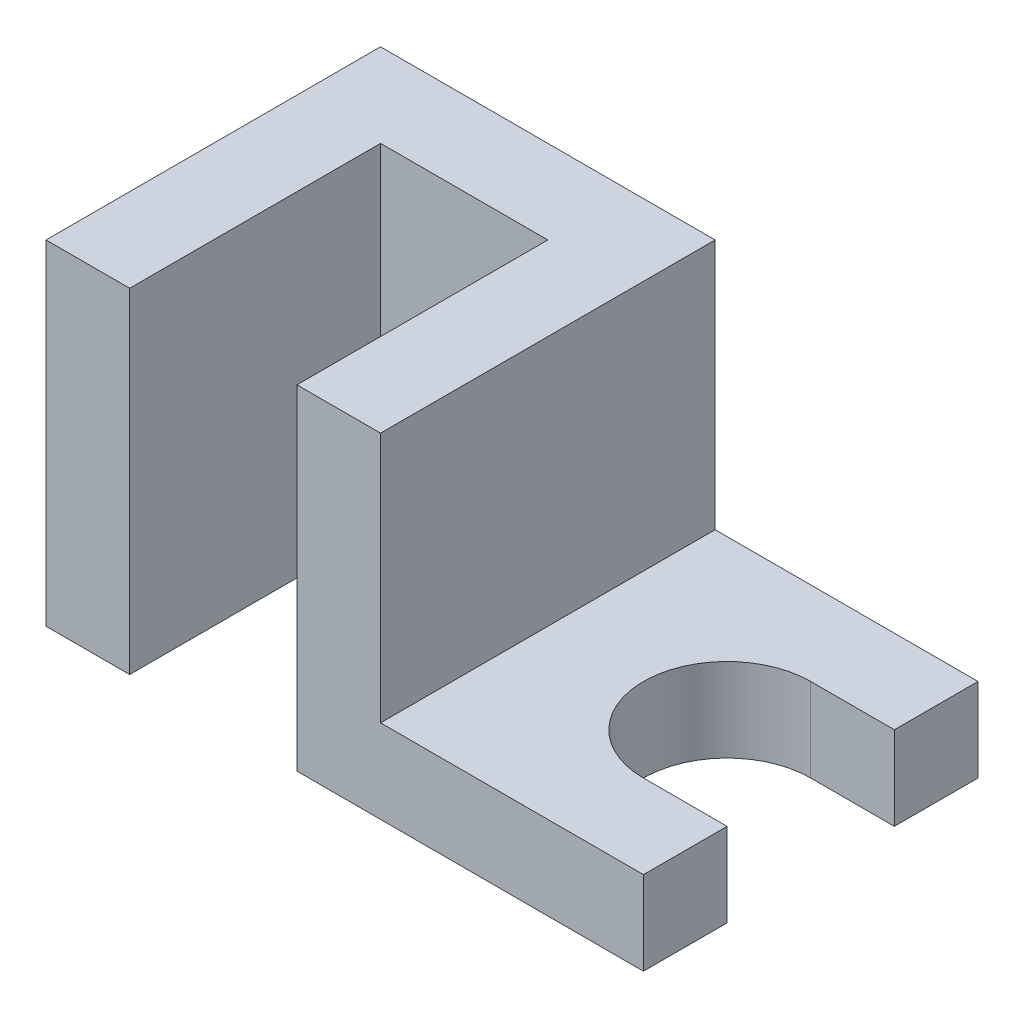
ISO-10303-21;
HEADER;
FILE_DESCRIPTION(('STEP AP214'),'2;1');
FILE_NAME('part.step','',(''),(''),'','','');
FILE_SCHEMA(('AUTOMOTIVE_DESIGN { 1 0 10303 214 1 1 1 1 }'));
ENDSEC;
DATA;
#1=APPLICATION_CONTEXT('core data for automotive mechanical design processes');
#2=APPLICATION_PROTOCOL_DEFINITION('international standard','automotive_design',2000,#1);
#3=PRODUCT_CONTEXT('',#1,'mechanical');
#4=PRODUCT('Part','Part','',(#3));
#5=PRODUCT_RELATED_PRODUCT_CATEGORY('part','',(#4));
#6=PRODUCT_DEFINITION_FORMATION('','',#4);
#7=PRODUCT_DEFINITION_CONTEXT('part definition',#1,'design');
#8=PRODUCT_DEFINITION('design','',#6,#7);
#9=PRODUCT_DEFINITION_SHAPE('','',#8);
#10=(LENGTH_UNIT() NAMED_UNIT(*) SI_UNIT(.MILLI.,.METRE.));
#11=(NAMED_UNIT(*) PLANE_ANGLE_UNIT() SI_UNIT($,.RADIAN.));
#12=(NAMED_UNIT(*) SI_UNIT($,.STERADIAN.) SOLID_ANGLE_UNIT());
#13=UNCERTAINTY_MEASURE_WITH_UNIT(LENGTH_MEASURE(1.E-05),#10,'distance_accuracy_value','');
#14=(GEOMETRIC_REPRESENTATION_CONTEXT(3) GLOBAL_UNCERTAINTY_ASSIGNED_CONTEXT((#13)) GLOBAL_UNIT_ASSIGNED_CONTEXT((#10,
#11,#12)) REPRESENTATION_CONTEXT('',''));
#15=CARTESIAN_POINT('',(0.,0.,0.));
#16=DIRECTION('',(0.,0.,1.));
#17=DIRECTION('',(1.,0.,0.));
#18=AXIS2_PLACEMENT_3D('',#15,#16,#17);
#19=CARTESIAN_POINT('',(43.,7.,-14.));
#20=DIRECTION('',(0.,-1.,0.));
#21=DIRECTION('',(0.,0.,-1.));
#22=AXIS2_PLACEMENT_3D('',#19,#20,#21);
#23=CYLINDRICAL_SURFACE('',#22,7.);
#24=CARTESIAN_POINT('',(43.,0.,-14.));
#25=DIRECTION('',(0.,1.,0.));
#26=DIRECTION('',(0.,0.,1.));
#27=AXIS2_PLACEMENT_3D('',#24,#25,#26);
#28=CIRCLE('',#27,7.);
#29=CARTESIAN_POINT('',(43.,0.,-21.));
#30=VERTEX_POINT('',#29);
#31=CARTESIAN_POINT('',(43.,0.,-7.00000000000001));
#32=VERTEX_POINT('',#31);
#33=EDGE_CURVE('E130',#30,#32,#28,.T.);
#34=ORIENTED_EDGE('',*,*,#33,.F.);
#35=DIRECTION('',(0.,-1.,0.));
#36=VECTOR('',#35,1.);
#37=CARTESIAN_POINT('',(43.,7.,-21.));
#38=LINE('',#37,#36);
#39=CARTESIAN_POINT('',(43.,7.,-21.));
#40=VERTEX_POINT('',#39);
#41=EDGE_CURVE('E11',#40,#30,#38,.T.);
#42=ORIENTED_EDGE('',*,*,#41,.F.);
#43=CARTESIAN_POINT('',(43.,7.,-14.));
#44=DIRECTION('',(0.,1.,0.));
#45=DIRECTION('',(0.,0.,1.));
#46=AXIS2_PLACEMENT_3D('',#43,#44,#45);
#47=CIRCLE('',#46,7.);
#48=CARTESIAN_POINT('',(43.,7.,-7.00000000000001));
#49=VERTEX_POINT('',#48);
#50=EDGE_CURVE('E148',#40,#49,#47,.T.);
#51=ORIENTED_EDGE('',*,*,#50,.T.);
#52=DIRECTION('',(0.,-1.,0.));
#53=VECTOR('',#52,1.);
#54=CARTESIAN_POINT('',(43.,7.,-7.00000000000001));
#55=LINE('',#54,#53);
#56=EDGE_CURVE('E57',#49,#32,#55,.T.);
#57=ORIENTED_EDGE('',*,*,#56,.T.);
#58=EDGE_LOOP('',(#34,#42,#51,#57));
#59=FACE_BOUND('',#58,.T.);
#60=ADVANCED_FACE('F41',(#59),#23,.F.);
#61=CARTESIAN_POINT('',(0.,7.,-21.));
#62=DIRECTION('',(0.,0.,1.));
#63=DIRECTION('',(1.,0.,0.));
#64=AXIS2_PLACEMENT_3D('',#61,#62,#63);
#65=PLANE('',#64);
#66=DIRECTION('',(-1.,0.,0.));
#67=VECTOR('',#66,1.);
#68=CARTESIAN_POINT('',(0.,0.,-21.));
#69=LINE('',#68,#67);
#70=CARTESIAN_POINT('',(50.,0.,-21.));
#71=VERTEX_POINT('',#70);
#72=EDGE_CURVE('E132',#71,#30,#69,.T.);
#73=ORIENTED_EDGE('',*,*,#72,.F.);
#74=DIRECTION('',(0.,-1.,0.));
#75=VECTOR('',#74,1.);
#76=CARTESIAN_POINT('',(50.,7.,-21.));
#77=LINE('',#76,#75);
#78=CARTESIAN_POINT('',(50.,7.,-21.));
#79=VERTEX_POINT('',#78);
#80=EDGE_CURVE('E49',#79,#71,#77,.T.);
#81=ORIENTED_EDGE('',*,*,#80,.F.);
#82=DIRECTION('',(-1.,0.,0.));
#83=VECTOR('',#82,1.);
#84=CARTESIAN_POINT('',(0.,7.,-21.));
#85=LINE('',#84,#83);
#86=EDGE_CURVE('E197',#79,#40,#85,.T.);
#87=ORIENTED_EDGE('',*,*,#86,.T.);
#88=ORIENTED_EDGE('',*,*,#41,.T.);
#89=EDGE_LOOP('',(#73,#81,#87,#88));
#90=FACE_BOUND('',#89,.T.);
#91=ADVANCED_FACE('F161',(#90),#65,.T.);
#92=CARTESIAN_POINT('',(50.,7.,0.));
#93=DIRECTION('',(1.,0.,0.));
#94=DIRECTION('',(0.,0.,-1.));
#95=AXIS2_PLACEMENT_3D('',#92,#93,#94);
#96=PLANE('',#95);
#97=DIRECTION('',(0.,0.,1.));
#98=VECTOR('',#97,1.);
#99=CARTESIAN_POINT('',(50.,0.,0.));
#100=LINE('',#99,#98);
#101=CARTESIAN_POINT('',(50.,0.,-28.));
#102=VERTEX_POINT('',#101);
#103=EDGE_CURVE('E136',#102,#71,#100,.T.);
#104=ORIENTED_EDGE('',*,*,#103,.F.);
#105=DIRECTION('',(0.,-1.,0.));
#106=VECTOR('',#105,1.);
#107=CARTESIAN_POINT('',(50.,7.,-28.));
#108=LINE('',#107,#106);
#109=CARTESIAN_POINT('',(50.,7.,-28.));
#110=VERTEX_POINT('',#109);
#111=EDGE_CURVE('E112',#110,#102,#108,.T.);
#112=ORIENTED_EDGE('',*,*,#111,.F.);
#113=DIRECTION('',(0.,0.,1.));
#114=VECTOR('',#113,1.);
#115=CARTESIAN_POINT('',(50.,7.,0.));
#116=LINE('',#115,#114);
#117=EDGE_CURVE('E157',#110,#79,#116,.T.);
#118=ORIENTED_EDGE('',*,*,#117,.T.);
#119=ORIENTED_EDGE('',*,*,#80,.T.);
#120=EDGE_LOOP('',(#104,#112,#118,#119));
#121=FACE_BOUND('',#120,.T.);
#122=ADVANCED_FACE('F155',(#121),#96,.T.);
#123=CARTESIAN_POINT('',(0.,7.,-28.));
#124=DIRECTION('',(0.,0.,-1.));
#125=DIRECTION('',(-1.,0.,0.));
#126=AXIS2_PLACEMENT_3D('',#123,#124,#125);
#127=PLANE('',#126);
#128=DIRECTION('',(1.,0.,0.));
#129=VECTOR('',#128,1.);
#130=CARTESIAN_POINT('',(0.,0.,-28.));
#131=LINE('',#130,#129);
#132=CARTESIAN_POINT('',(0.,0.,-28.));
#133=VERTEX_POINT('',#132);
#134=EDGE_CURVE('E139',#133,#102,#131,.T.);
#135=ORIENTED_EDGE('',*,*,#134,.F.);
#136=DIRECTION('',(0.,-1.,0.));
#137=VECTOR('',#136,1.);
#138=CARTESIAN_POINT('',(0.,28.,-28.));
#139=LINE('',#138,#137);
#140=CARTESIAN_POINT('',(0.,28.,-28.));
#141=VERTEX_POINT('',#140);
#142=EDGE_CURVE('E176',#141,#133,#139,.T.);
#143=ORIENTED_EDGE('',*,*,#142,.F.);
#144=DIRECTION('',(1.,0.,0.));
#145=VECTOR('',#144,1.);
#146=CARTESIAN_POINT('',(0.,28.,-28.));
#147=LINE('',#146,#145);
#148=CARTESIAN_POINT('',(28.,28.,-28.));
#149=VERTEX_POINT('',#148);
#150=EDGE_CURVE('E289',#141,#149,#147,.T.);
#151=ORIENTED_EDGE('',*,*,#150,.T.);
#152=DIRECTION('',(0.,-1.,0.));
#153=VECTOR('',#152,1.);
#154=CARTESIAN_POINT('',(28.,28.,-28.));
#155=LINE('',#154,#153);
#156=CARTESIAN_POINT('',(28.,7.,-28.));
#157=VERTEX_POINT('',#156);
#158=EDGE_CURVE('E133',#149,#157,#155,.T.);
#159=ORIENTED_EDGE('',*,*,#158,.T.);
#160=DIRECTION('',(1.,0.,0.));
#161=VECTOR('',#160,1.);
#162=CARTESIAN_POINT('',(0.,7.,-28.));
#163=LINE('',#162,#161);
#164=EDGE_CURVE('E200',#157,#110,#163,.T.);
#165=ORIENTED_EDGE('',*,*,#164,.T.);
#166=ORIENTED_EDGE('',*,*,#111,.T.);
#167=EDGE_LOOP('',(#135,#143,#151,#159,#165,#166));
#168=FACE_BOUND('',#167,.T.);
#169=ADVANCED_FACE('F173',(#168),#127,.T.);
#170=CARTESIAN_POINT('',(0.,7.,0.));
#171=DIRECTION('',(0.,0.,1.));
#172=DIRECTION('',(1.,0.,0.));
#173=AXIS2_PLACEMENT_3D('',#170,#171,#172);
#174=PLANE('',#173);
#175=DIRECTION('',(-1.,0.,0.));
#176=VECTOR('',#175,1.);
#177=CARTESIAN_POINT('',(0.,0.,0.));
#178=LINE('',#177,#176);
#179=CARTESIAN_POINT('',(50.,0.,0.));
#180=VERTEX_POINT('',#179);
#181=CARTESIAN_POINT('',(21.,0.,0.));
#182=VERTEX_POINT('',#181);
#183=EDGE_CURVE('E108',#180,#182,#178,.T.);
#184=ORIENTED_EDGE('',*,*,#183,.F.);
#185=DIRECTION('',(0.,-1.,0.));
#186=VECTOR('',#185,1.);
#187=CARTESIAN_POINT('',(50.,7.,0.));
#188=LINE('',#187,#186);
#189=CARTESIAN_POINT('',(50.,7.,0.));
#190=VERTEX_POINT('',#189);
#191=EDGE_CURVE('E101',#190,#180,#188,.T.);
#192=ORIENTED_EDGE('',*,*,#191,.F.);
#193=DIRECTION('',(-1.,0.,0.));
#194=VECTOR('',#193,1.);
#195=CARTESIAN_POINT('',(0.,7.,0.));
#196=LINE('',#195,#194);
#197=CARTESIAN_POINT('',(28.,7.,0.));
#198=VERTEX_POINT('',#197);
#199=EDGE_CURVE('E105',#190,#198,#196,.T.);
#200=ORIENTED_EDGE('',*,*,#199,.T.);
#201=DIRECTION('',(0.,-1.,0.));
#202=VECTOR('',#201,1.);
#203=CARTESIAN_POINT('',(28.,28.,0.));
#204=LINE('',#203,#202);
#205=CARTESIAN_POINT('',(28.,28.,0.));
#206=VERTEX_POINT('',#205);
#207=EDGE_CURVE('E207',#206,#198,#204,.T.);
#208=ORIENTED_EDGE('',*,*,#207,.F.);
#209=DIRECTION('',(-1.,0.,0.));
#210=VECTOR('',#209,1.);
#211=CARTESIAN_POINT('',(0.,28.,0.));
#212=LINE('',#211,#210);
#213=CARTESIAN_POINT('',(21.,28.,0.));
#214=VERTEX_POINT('',#213);
#215=EDGE_CURVE('E264',#206,#214,#212,.T.);
#216=ORIENTED_EDGE('',*,*,#215,.T.);
#217=DIRECTION('',(0.,-1.,0.));
#218=VECTOR('',#217,1.);
#219=CARTESIAN_POINT('',(21.,28.,0.));
#220=LINE('',#219,#218);
#221=EDGE_CURVE('E251',#214,#182,#220,.T.);
#222=ORIENTED_EDGE('',*,*,#221,.T.);
#223=EDGE_LOOP('',(#184,#192,#200,#208,#216,#222));
#224=FACE_BOUND('',#223,.T.);
#225=ADVANCED_FACE('F103',(#224),#174,.T.);
#226=CARTESIAN_POINT('',(50.,7.,0.));
#227=DIRECTION('',(1.,0.,0.));
#228=DIRECTION('',(0.,0.,-1.));
#229=AXIS2_PLACEMENT_3D('',#226,#227,#228);
#230=PLANE('',#229);
#231=DIRECTION('',(0.,0.,1.));
#232=VECTOR('',#231,1.);
#233=CARTESIAN_POINT('',(50.,0.,0.));
#234=LINE('',#233,#232);
#235=CARTESIAN_POINT('',(50.,0.,-7.00000000000001));
#236=VERTEX_POINT('',#235);
#237=EDGE_CURVE('E143',#236,#180,#234,.T.);
#238=ORIENTED_EDGE('',*,*,#237,.F.);
#239=DIRECTION('',(0.,-1.,0.));
#240=VECTOR('',#239,1.);
#241=CARTESIAN_POINT('',(50.,7.,-7.00000000000001));
#242=LINE('',#241,#240);
#243=CARTESIAN_POINT('',(50.,7.,-7.00000000000001));
#244=VERTEX_POINT('',#243);
#245=EDGE_CURVE('E77',#244,#236,#242,.T.);
#246=ORIENTED_EDGE('',*,*,#245,.F.);
#247=DIRECTION('',(0.,0.,1.));
#248=VECTOR('',#247,1.);
#249=CARTESIAN_POINT('',(50.,7.,0.));
#250=LINE('',#249,#248);
#251=EDGE_CURVE('E119',#244,#190,#250,.T.);
#252=ORIENTED_EDGE('',*,*,#251,.T.);
#253=ORIENTED_EDGE('',*,*,#191,.T.);
#254=EDGE_LOOP('',(#238,#246,#252,#253));
#255=FACE_BOUND('',#254,.T.);
#256=ADVANCED_FACE('F124',(#255),#230,.T.);
#257=CARTESIAN_POINT('',(0.,7.,-7.00000000000001));
#258=DIRECTION('',(0.,0.,-1.));
#259=DIRECTION('',(-1.,0.,0.));
#260=AXIS2_PLACEMENT_3D('',#257,#258,#259);
#261=PLANE('',#260);
#262=DIRECTION('',(1.,0.,0.));
#263=VECTOR('',#262,1.);
#264=CARTESIAN_POINT('',(0.,0.,-7.00000000000001));
#265=LINE('',#264,#263);
#266=EDGE_CURVE('E145',#32,#236,#265,.T.);
#267=ORIENTED_EDGE('',*,*,#266,.F.);
#268=ORIENTED_EDGE('',*,*,#56,.F.);
#269=DIRECTION('',(1.,0.,0.));
#270=VECTOR('',#269,1.);
#271=CARTESIAN_POINT('',(0.,7.,-7.00000000000001));
#272=LINE('',#271,#270);
#273=EDGE_CURVE('E125',#49,#244,#272,.T.);
#274=ORIENTED_EDGE('',*,*,#273,.T.);
#275=ORIENTED_EDGE('',*,*,#245,.T.);
#276=EDGE_LOOP('',(#267,#268,#274,#275));
#277=FACE_BOUND('',#276,.T.);
#278=ADVANCED_FACE('F308',(#277),#261,.T.);
#279=CARTESIAN_POINT('',(0.,7.,0.));
#280=DIRECTION('',(0.,1.,0.));
#281=DIRECTION('',(0.,0.,1.));
#282=AXIS2_PLACEMENT_3D('',#279,#280,#281);
#283=PLANE('',#282);
#284=ORIENTED_EDGE('',*,*,#50,.F.);
#285=ORIENTED_EDGE('',*,*,#86,.F.);
#286=ORIENTED_EDGE('',*,*,#117,.F.);
#287=ORIENTED_EDGE('',*,*,#164,.F.);
#288=DIRECTION('',(0.,0.,1.));
#289=VECTOR('',#288,1.);
#290=CARTESIAN_POINT('',(28.,7.,0.));
#291=LINE('',#290,#289);
#292=EDGE_CURVE('E122',#157,#198,#291,.T.);
#293=ORIENTED_EDGE('',*,*,#292,.T.);
#294=ORIENTED_EDGE('',*,*,#199,.F.);
#295=ORIENTED_EDGE('',*,*,#251,.F.);
#296=ORIENTED_EDGE('',*,*,#273,.F.);
#297=EDGE_LOOP('',(#284,#285,#286,#287,#293,#294,#295,#296));
#298=FACE_BOUND('',#297,.T.);
#299=ADVANCED_FACE('F117',(#298),#283,.T.);
#300=CARTESIAN_POINT('',(0.,0.,0.));
#301=DIRECTION('',(0.,1.,0.));
#302=DIRECTION('',(0.,0.,1.));
#303=AXIS2_PLACEMENT_3D('',#300,#301,#302);
#304=PLANE('',#303);
#305=ORIENTED_EDGE('',*,*,#33,.T.);
#306=ORIENTED_EDGE('',*,*,#266,.T.);
#307=ORIENTED_EDGE('',*,*,#237,.T.);
#308=ORIENTED_EDGE('',*,*,#183,.T.);
#309=DIRECTION('',(0.,0.,-1.));
#310=VECTOR('',#309,1.);
#311=CARTESIAN_POINT('',(21.,0.,0.));
#312=LINE('',#311,#310);
#313=CARTESIAN_POINT('',(21.,0.,-21.));
#314=VERTEX_POINT('',#313);
#315=EDGE_CURVE('E276',#182,#314,#312,.T.);
#316=ORIENTED_EDGE('',*,*,#315,.T.);
#317=DIRECTION('',(-1.,0.,0.));
#318=VECTOR('',#317,1.);
#319=CARTESIAN_POINT('',(0.,0.,-21.));
#320=LINE('',#319,#318);
#321=CARTESIAN_POINT('',(7.,0.,-21.));
#322=VERTEX_POINT('',#321);
#323=EDGE_CURVE('E246',#314,#322,#320,.T.);
#324=ORIENTED_EDGE('',*,*,#323,.T.);
#325=DIRECTION('',(0.,0.,1.));
#326=VECTOR('',#325,1.);
#327=CARTESIAN_POINT('',(7.,0.,0.));
#328=LINE('',#327,#326);
#329=CARTESIAN_POINT('',(7.,0.,0.));
#330=VERTEX_POINT('',#329);
#331=EDGE_CURVE('E272',#322,#330,#328,.T.);
#332=ORIENTED_EDGE('',*,*,#331,.T.);
#333=DIRECTION('',(-1.,0.,0.));
#334=VECTOR('',#333,1.);
#335=CARTESIAN_POINT('',(0.,0.,0.));
#336=LINE('',#335,#334);
#337=CARTESIAN_POINT('',(0.,0.,0.));
#338=VERTEX_POINT('',#337);
#339=EDGE_CURVE('E270',#330,#338,#336,.T.);
#340=ORIENTED_EDGE('',*,*,#339,.T.);
#341=DIRECTION('',(0.,0.,-1.));
#342=VECTOR('',#341,1.);
#343=CARTESIAN_POINT('',(0.,0.,0.));
#344=LINE('',#343,#342);
#345=EDGE_CURVE('E169',#338,#133,#344,.T.);
#346=ORIENTED_EDGE('',*,*,#345,.T.);
#347=ORIENTED_EDGE('',*,*,#134,.T.);
#348=ORIENTED_EDGE('',*,*,#103,.T.);
#349=ORIENTED_EDGE('',*,*,#72,.T.);
#350=EDGE_LOOP('',(#305,#306,#307,#308,#316,#324,#332,#340,#346,#347,#348,#349));
#351=FACE_BOUND('',#350,.T.);
#352=ADVANCED_FACE('F163',(#351),#304,.F.);
#353=CARTESIAN_POINT('',(28.,28.,0.));
#354=DIRECTION('',(1.,0.,0.));
#355=DIRECTION('',(0.,0.,-1.));
#356=AXIS2_PLACEMENT_3D('',#353,#354,#355);
#357=PLANE('',#356);
#358=ORIENTED_EDGE('',*,*,#292,.F.);
#359=ORIENTED_EDGE('',*,*,#158,.F.);
#360=DIRECTION('',(0.,0.,1.));
#361=VECTOR('',#360,1.);
#362=CARTESIAN_POINT('',(28.,28.,0.));
#363=LINE('',#362,#361);
#364=EDGE_CURVE('E278',#149,#206,#363,.T.);
#365=ORIENTED_EDGE('',*,*,#364,.T.);
#366=ORIENTED_EDGE('',*,*,#207,.T.);
#367=EDGE_LOOP('',(#358,#359,#365,#366));
#368=FACE_BOUND('',#367,.T.);
#369=ADVANCED_FACE('F294',(#368),#357,.T.);
#370=CARTESIAN_POINT('',(0.,28.,0.));
#371=DIRECTION('',(-1.,0.,0.));
#372=DIRECTION('',(0.,0.,1.));
#373=AXIS2_PLACEMENT_3D('',#370,#371,#372);
#374=PLANE('',#373);
#375=ORIENTED_EDGE('',*,*,#345,.F.);
#376=DIRECTION('',(0.,-1.,0.));
#377=VECTOR('',#376,1.);
#378=CARTESIAN_POINT('',(0.,28.,0.));
#379=LINE('',#378,#377);
#380=CARTESIAN_POINT('',(0.,28.,0.));
#381=VERTEX_POINT('',#380);
#382=EDGE_CURVE('E187',#381,#338,#379,.T.);
#383=ORIENTED_EDGE('',*,*,#382,.F.);
#384=DIRECTION('',(0.,0.,-1.));
#385=VECTOR('',#384,1.);
#386=CARTESIAN_POINT('',(0.,28.,0.));
#387=LINE('',#386,#385);
#388=EDGE_CURVE('E186',#381,#141,#387,.T.);
#389=ORIENTED_EDGE('',*,*,#388,.T.);
#390=ORIENTED_EDGE('',*,*,#142,.T.);
#391=EDGE_LOOP('',(#375,#383,#389,#390));
#392=FACE_BOUND('',#391,.T.);
#393=ADVANCED_FACE('F183',(#392),#374,.T.);
#394=CARTESIAN_POINT('',(0.,28.,0.));
#395=DIRECTION('',(0.,0.,1.));
#396=DIRECTION('',(1.,0.,0.));
#397=AXIS2_PLACEMENT_3D('',#394,#395,#396);
#398=PLANE('',#397);
#399=ORIENTED_EDGE('',*,*,#339,.F.);
#400=DIRECTION('',(0.,-1.,0.));
#401=VECTOR('',#400,1.);
#402=CARTESIAN_POINT('',(7.,28.,0.));
#403=LINE('',#402,#401);
#404=CARTESIAN_POINT('',(7.,28.,0.));
#405=VERTEX_POINT('',#404);
#406=EDGE_CURVE('E192',#405,#330,#403,.T.);
#407=ORIENTED_EDGE('',*,*,#406,.F.);
#408=DIRECTION('',(-1.,0.,0.));
#409=VECTOR('',#408,1.);
#410=CARTESIAN_POINT('',(0.,28.,0.));
#411=LINE('',#410,#409);
#412=EDGE_CURVE('E288',#405,#381,#411,.T.);
#413=ORIENTED_EDGE('',*,*,#412,.T.);
#414=ORIENTED_EDGE('',*,*,#382,.T.);
#415=EDGE_LOOP('',(#399,#407,#413,#414));
#416=FACE_BOUND('',#415,.T.);
#417=ADVANCED_FACE('F287',(#416),#398,.T.);
#418=CARTESIAN_POINT('',(7.,28.,0.));
#419=DIRECTION('',(1.,0.,0.));
#420=DIRECTION('',(0.,0.,-1.));
#421=AXIS2_PLACEMENT_3D('',#418,#419,#420);
#422=PLANE('',#421);
#423=ORIENTED_EDGE('',*,*,#331,.F.);
#424=DIRECTION('',(0.,-1.,0.));
#425=VECTOR('',#424,1.);
#426=CARTESIAN_POINT('',(7.,28.,-21.));
#427=LINE('',#426,#425);
#428=CARTESIAN_POINT('',(7.,28.,-21.));
#429=VERTEX_POINT('',#428);
#430=EDGE_CURVE('E250',#429,#322,#427,.T.);
#431=ORIENTED_EDGE('',*,*,#430,.F.);
#432=DIRECTION('',(0.,0.,1.));
#433=VECTOR('',#432,1.);
#434=CARTESIAN_POINT('',(7.,28.,0.));
#435=LINE('',#434,#433);
#436=EDGE_CURVE('E261',#429,#405,#435,.T.);
#437=ORIENTED_EDGE('',*,*,#436,.T.);
#438=ORIENTED_EDGE('',*,*,#406,.T.);
#439=EDGE_LOOP('',(#423,#431,#437,#438));
#440=FACE_BOUND('',#439,.T.);
#441=ADVANCED_FACE('F284',(#440),#422,.T.);
#442=CARTESIAN_POINT('',(0.,28.,-21.));
#443=DIRECTION('',(0.,0.,1.));
#444=DIRECTION('',(1.,0.,0.));
#445=AXIS2_PLACEMENT_3D('',#442,#443,#444);
#446=PLANE('',#445);
#447=ORIENTED_EDGE('',*,*,#323,.F.);
#448=DIRECTION('',(0.,-1.,0.));
#449=VECTOR('',#448,1.);
#450=CARTESIAN_POINT('',(21.,28.,-21.));
#451=LINE('',#450,#449);
#452=CARTESIAN_POINT('',(21.,28.,-21.));
#453=VERTEX_POINT('',#452);
#454=EDGE_CURVE('E241',#453,#314,#451,.T.);
#455=ORIENTED_EDGE('',*,*,#454,.F.);
#456=DIRECTION('',(-1.,0.,0.));
#457=VECTOR('',#456,1.);
#458=CARTESIAN_POINT('',(0.,28.,-21.));
#459=LINE('',#458,#457);
#460=EDGE_CURVE('E244',#453,#429,#459,.T.);
#461=ORIENTED_EDGE('',*,*,#460,.T.);
#462=ORIENTED_EDGE('',*,*,#430,.T.);
#463=EDGE_LOOP('',(#447,#455,#461,#462));
#464=FACE_BOUND('',#463,.T.);
#465=ADVANCED_FACE('F243',(#464),#446,.T.);
#466=CARTESIAN_POINT('',(21.,28.,0.));
#467=DIRECTION('',(-1.,0.,0.));
#468=DIRECTION('',(0.,0.,1.));
#469=AXIS2_PLACEMENT_3D('',#466,#467,#468);
#470=PLANE('',#469);
#471=ORIENTED_EDGE('',*,*,#315,.F.);
#472=ORIENTED_EDGE('',*,*,#221,.F.);
#473=DIRECTION('',(0.,0.,-1.));
#474=VECTOR('',#473,1.);
#475=CARTESIAN_POINT('',(21.,28.,0.));
#476=LINE('',#475,#474);
#477=EDGE_CURVE('E258',#214,#453,#476,.T.);
#478=ORIENTED_EDGE('',*,*,#477,.T.);
#479=ORIENTED_EDGE('',*,*,#454,.T.);
#480=EDGE_LOOP('',(#471,#472,#478,#479));
#481=FACE_BOUND('',#480,.T.);
#482=ADVANCED_FACE('F263',(#481),#470,.T.);
#483=CARTESIAN_POINT('',(0.,28.,0.));
#484=DIRECTION('',(0.,1.,0.));
#485=DIRECTION('',(0.,0.,1.));
#486=AXIS2_PLACEMENT_3D('',#483,#484,#485);
#487=PLANE('',#486);
#488=ORIENTED_EDGE('',*,*,#364,.F.);
#489=ORIENTED_EDGE('',*,*,#150,.F.);
#490=ORIENTED_EDGE('',*,*,#388,.F.);
#491=ORIENTED_EDGE('',*,*,#412,.F.);
#492=ORIENTED_EDGE('',*,*,#436,.F.);
#493=ORIENTED_EDGE('',*,*,#460,.F.);
#494=ORIENTED_EDGE('',*,*,#477,.F.);
#495=ORIENTED_EDGE('',*,*,#215,.F.);
#496=EDGE_LOOP('',(#488,#489,#490,#491,#492,#493,#494,#495));
#497=FACE_BOUND('',#496,.T.);
#498=ADVANCED_FACE('F256',(#497),#487,.T.);
#499=CLOSED_SHELL('',(#60,#91,#122,#169,#225,#256,#278,#299,#352,#369,#393,#417,#441,#465,#482,#498));
#500=MANIFOLD_SOLID_BREP('B2',#499);
#501=ADVANCED_BREP_SHAPE_REPRESENTATION('',(#18,#500),#14);
#502=SHAPE_DEFINITION_REPRESENTATION(#9,#501);
ENDSEC;
END-ISO-10303-21;
